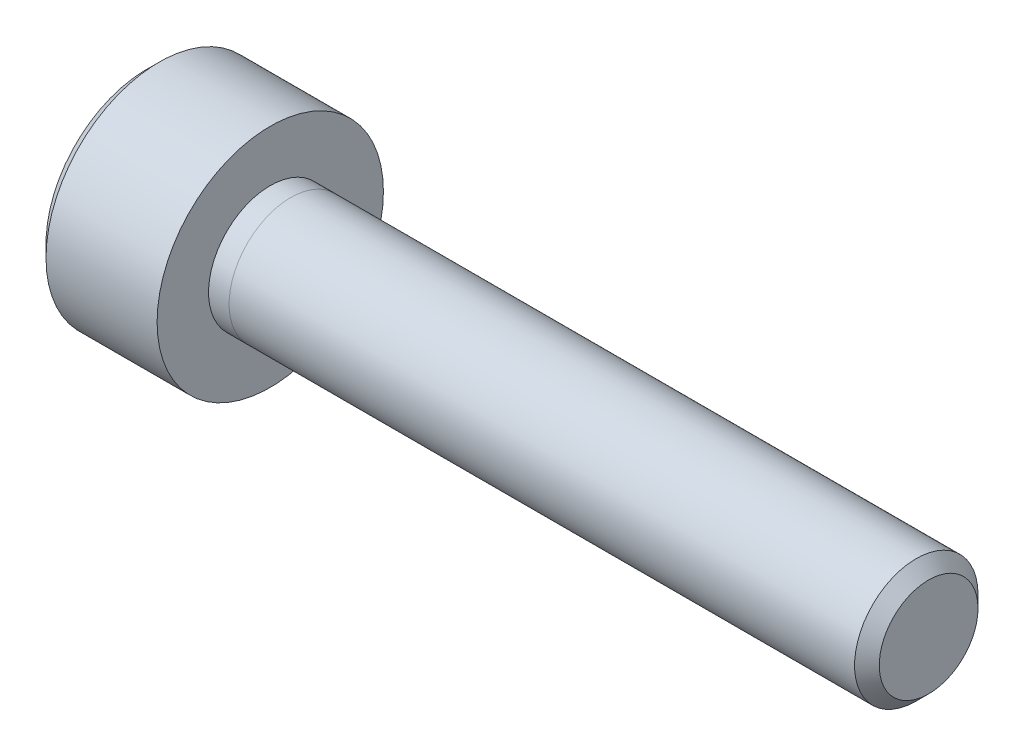
ISO-10303-21;
HEADER;
FILE_DESCRIPTION(('STEP AP214'),'2;1');
FILE_NAME('part.step','',(''),(''),'','','');
FILE_SCHEMA(('AUTOMOTIVE_DESIGN { 1 0 10303 214 1 1 1 1 }'));
ENDSEC;
DATA;
#1=APPLICATION_CONTEXT('core data for automotive mechanical design processes');
#2=APPLICATION_PROTOCOL_DEFINITION('international standard','automotive_design',2000,#1);
#3=PRODUCT_CONTEXT('',#1,'mechanical');
#4=PRODUCT('Part','Part','',(#3));
#5=PRODUCT_RELATED_PRODUCT_CATEGORY('part','',(#4));
#6=PRODUCT_DEFINITION_FORMATION('','',#4);
#7=PRODUCT_DEFINITION_CONTEXT('part definition',#1,'design');
#8=PRODUCT_DEFINITION('design','',#6,#7);
#9=PRODUCT_DEFINITION_SHAPE('','',#8);
#10=(LENGTH_UNIT() NAMED_UNIT(*) SI_UNIT(.MILLI.,.METRE.));
#11=(NAMED_UNIT(*) PLANE_ANGLE_UNIT() SI_UNIT($,.RADIAN.));
#12=(NAMED_UNIT(*) SI_UNIT($,.STERADIAN.) SOLID_ANGLE_UNIT());
#13=UNCERTAINTY_MEASURE_WITH_UNIT(LENGTH_MEASURE(1.E-05),#10,'distance_accuracy_value','');
#14=(GEOMETRIC_REPRESENTATION_CONTEXT(3) GLOBAL_UNCERTAINTY_ASSIGNED_CONTEXT((#13)) GLOBAL_UNIT_ASSIGNED_CONTEXT((#10,
#11,#12)) REPRESENTATION_CONTEXT('',''));
#15=CARTESIAN_POINT('',(0.,0.,0.));
#16=DIRECTION('',(0.,0.,1.));
#17=DIRECTION('',(1.,0.,0.));
#18=AXIS2_PLACEMENT_3D('',#15,#16,#17);
#19=CARTESIAN_POINT('',(19.,0.,0.));
#20=DIRECTION('',(-1.,0.,0.));
#21=DIRECTION('',(0.,0.,1.));
#22=AXIS2_PLACEMENT_3D('',#19,#20,#21);
#23=CYLINDRICAL_SURFACE('',#22,1.5);
#24=CARTESIAN_POINT('',(18.7,0.,0.));
#25=DIRECTION('',(1.,0.,0.));
#26=DIRECTION('',(0.,0.,-1.));
#27=AXIS2_PLACEMENT_3D('',#24,#25,#26);
#28=CIRCLE('',#27,1.5);
#29=CARTESIAN_POINT('',(18.7,0.,-1.5));
#30=VERTEX_POINT('',#29);
#31=EDGE_CURVE('E11',#30,#30,#28,.F.);
#32=ORIENTED_EDGE('',*,*,#31,.T.);
#33=EDGE_LOOP('',(#32));
#34=FACE_BOUND('',#33,.T.);
#35=CARTESIAN_POINT('',(3.5,0.,0.));
#36=DIRECTION('',(1.,0.,0.));
#37=DIRECTION('',(0.,0.,-1.));
#38=AXIS2_PLACEMENT_3D('',#35,#36,#37);
#39=CIRCLE('',#38,1.5);
#40=CARTESIAN_POINT('',(3.5,0.,-1.5));
#41=VERTEX_POINT('',#40);
#42=EDGE_CURVE('E63',#41,#41,#39,.T.);
#43=ORIENTED_EDGE('',*,*,#42,.T.);
#44=EDGE_LOOP('',(#43));
#45=FACE_BOUND('',#44,.T.);
#46=ADVANCED_FACE('F50',(#34,#45),#23,.T.);
#47=CARTESIAN_POINT('',(19.,0.,0.));
#48=DIRECTION('',(1.,0.,0.));
#49=DIRECTION('',(0.,0.,-1.));
#50=AXIS2_PLACEMENT_3D('',#47,#48,#49);
#51=PLANE('',#50);
#52=CARTESIAN_POINT('',(19.,0.,0.));
#53=DIRECTION('',(1.,0.,0.));
#54=DIRECTION('',(0.,0.,-1.));
#55=AXIS2_PLACEMENT_3D('',#52,#53,#54);
#56=CIRCLE('',#55,1.2);
#57=CARTESIAN_POINT('',(19.,0.,-1.2));
#58=VERTEX_POINT('',#57);
#59=EDGE_CURVE('E58',#58,#58,#56,.T.);
#60=ORIENTED_EDGE('',*,*,#59,.T.);
#61=EDGE_LOOP('',(#60));
#62=FACE_BOUND('',#61,.T.);
#63=ADVANCED_FACE('F74',(#62),#51,.T.);
#64=CARTESIAN_POINT('',(3.5,0.,0.));
#65=DIRECTION('',(1.,0.,0.));
#66=DIRECTION('',(0.,0.,-1.));
#67=AXIS2_PLACEMENT_3D('',#64,#65,#66);
#68=PLANE('',#67);
#69=ORIENTED_EDGE('',*,*,#42,.F.);
#70=EDGE_LOOP('',(#69));
#71=FACE_BOUND('',#70,.T.);
#72=ADVANCED_FACE('F72',(#71),#68,.F.);
#73=CARTESIAN_POINT('',(19.,0.,0.));
#74=DIRECTION('',(-1.,0.,0.));
#75=DIRECTION('',(0.,0.,1.));
#76=AXIS2_PLACEMENT_3D('',#73,#74,#75);
#77=CONICAL_SURFACE('',#76,1.2,0.785398163397449);
#78=ORIENTED_EDGE('',*,*,#31,.F.);
#79=EDGE_LOOP('',(#78));
#80=FACE_BOUND('',#79,.T.);
#81=ORIENTED_EDGE('',*,*,#59,.F.);
#82=EDGE_LOOP('',(#81));
#83=FACE_BOUND('',#82,.T.);
#84=ADVANCED_FACE('F52',(#80,#83),#77,.T.);
#85=CLOSED_SHELL('',(#46,#63,#72,#84));
#86=MANIFOLD_SOLID_BREP('B2',#85);
#87=CARTESIAN_POINT('',(3.,0.,0.));
#88=DIRECTION('',(1.,0.,0.));
#89=DIRECTION('',(0.,0.,-1.));
#90=AXIS2_PLACEMENT_3D('',#87,#88,#89);
#91=PLANE('',#90);
#92=CARTESIAN_POINT('',(3.,0.,0.));
#93=DIRECTION('',(1.,0.,0.));
#94=DIRECTION('',(0.,0.,-1.));
#95=AXIS2_PLACEMENT_3D('',#92,#93,#94);
#96=CIRCLE('',#95,2.75);
#97=CARTESIAN_POINT('',(3.,0.,-2.75));
#98=VERTEX_POINT('',#97);
#99=EDGE_CURVE('E244',#98,#98,#96,.T.);
#100=ORIENTED_EDGE('',*,*,#99,.T.);
#101=EDGE_LOOP('',(#100));
#102=FACE_BOUND('',#101,.T.);
#103=CARTESIAN_POINT('',(3.,0.,0.));
#104=DIRECTION('',(1.,0.,0.));
#105=DIRECTION('',(0.,0.,-1.));
#106=AXIS2_PLACEMENT_3D('',#103,#104,#105);
#107=CIRCLE('',#106,1.5);
#108=CARTESIAN_POINT('',(3.,0.,-1.5));
#109=VERTEX_POINT('',#108);
#110=EDGE_CURVE('E231',#109,#109,#107,.T.);
#111=ORIENTED_EDGE('',*,*,#110,.F.);
#112=EDGE_LOOP('',(#111));
#113=FACE_BOUND('',#112,.T.);
#114=ADVANCED_FACE('F114',(#102,#113),#91,.T.);
#115=CARTESIAN_POINT('',(3.,0.,0.));
#116=DIRECTION('',(-1.,0.,0.));
#117=DIRECTION('',(0.,0.,1.));
#118=AXIS2_PLACEMENT_3D('',#115,#116,#117);
#119=CYLINDRICAL_SURFACE('',#118,2.75);
#120=CARTESIAN_POINT('',(0.299999999999997,0.,0.));
#121=DIRECTION('',(1.,0.,0.));
#122=DIRECTION('',(0.,0.,-1.));
#123=AXIS2_PLACEMENT_3D('',#120,#121,#122);
#124=CIRCLE('',#123,2.75);
#125=CARTESIAN_POINT('',(0.299999999999997,0.,-2.75));
#126=VERTEX_POINT('',#125);
#127=EDGE_CURVE('E123',#126,#126,#124,.T.);
#128=ORIENTED_EDGE('',*,*,#127,.T.);
#129=EDGE_LOOP('',(#128));
#130=FACE_BOUND('',#129,.T.);
#131=ORIENTED_EDGE('',*,*,#99,.F.);
#132=EDGE_LOOP('',(#131));
#133=FACE_BOUND('',#132,.T.);
#134=ADVANCED_FACE('F253',(#130,#133),#119,.T.);
#135=CARTESIAN_POINT('',(0.,0.,0.));
#136=DIRECTION('',(1.,0.,0.));
#137=DIRECTION('',(0.,0.,-1.));
#138=AXIS2_PLACEMENT_3D('',#135,#136,#137);
#139=PLANE('',#138);
#140=DIRECTION('',(0.,0.792442347030254,-0.609946822791284));
#141=VECTOR('',#140,1.);
#142=CARTESIAN_POINT('',(0.,0.190537525520136,1.4307441367002));
#143=LINE('',#142,#141);
#144=CARTESIAN_POINT('',(0.,0.190537525520136,1.4307441367002));
#145=VERTEX_POINT('',#144);
#146=CARTESIAN_POINT('',(0.,1.33432953145808,0.550361730875436));
#147=VERTEX_POINT('',#146);
#148=EDGE_CURVE('E212',#145,#147,#143,.T.);
#149=ORIENTED_EDGE('',*,*,#148,.F.);
#150=DIRECTION('',(0.,0.924450617009985,0.381301792167121));
#151=VECTOR('',#150,1.);
#152=CARTESIAN_POINT('',(0.,-1.14379200593794,0.880382405824763));
#153=LINE('',#152,#151);
#154=CARTESIAN_POINT('',(0.,-1.14379200593794,0.880382405824763));
#155=VERTEX_POINT('',#154);
#156=EDGE_CURVE('E130',#155,#145,#153,.T.);
#157=ORIENTED_EDGE('',*,*,#156,.F.);
#158=DIRECTION('',(0.,0.132008269979731,0.991248614958406));
#159=VECTOR('',#158,1.);
#160=CARTESIAN_POINT('',(0.,-1.33432953145808,-0.550361730875436));
#161=LINE('',#160,#159);
#162=CARTESIAN_POINT('',(0.,-1.33432953145808,-0.550361730875436));
#163=VERTEX_POINT('',#162);
#164=EDGE_CURVE('E225',#163,#155,#161,.T.);
#165=ORIENTED_EDGE('',*,*,#164,.F.);
#166=DIRECTION('',(0.,-0.792442347030254,0.609946822791285));
#167=VECTOR('',#166,1.);
#168=CARTESIAN_POINT('',(0.,-0.190537525520136,-1.4307441367002));
#169=LINE('',#168,#167);
#170=CARTESIAN_POINT('',(0.,-0.190537525520136,-1.4307441367002));
#171=VERTEX_POINT('',#170);
#172=EDGE_CURVE('E222',#171,#163,#169,.T.);
#173=ORIENTED_EDGE('',*,*,#172,.F.);
#174=DIRECTION('',(0.,-0.924450617009985,-0.381301792167121));
#175=VECTOR('',#174,1.);
#176=CARTESIAN_POINT('',(0.,1.14379200593794,-0.880382405824763));
#177=LINE('',#176,#175);
#178=CARTESIAN_POINT('',(0.,1.14379200593794,-0.880382405824763));
#179=VERTEX_POINT('',#178);
#180=EDGE_CURVE('E178',#179,#171,#177,.T.);
#181=ORIENTED_EDGE('',*,*,#180,.F.);
#182=DIRECTION('',(0.,-0.132008269979731,-0.991248614958406));
#183=VECTOR('',#182,1.);
#184=CARTESIAN_POINT('',(0.,1.33432953145808,0.550361730875436));
#185=LINE('',#184,#183);
#186=EDGE_CURVE('E216',#147,#179,#185,.T.);
#187=ORIENTED_EDGE('',*,*,#186,.F.);
#188=EDGE_LOOP('',(#149,#157,#165,#173,#181,#187));
#189=FACE_BOUND('',#188,.T.);
#190=CARTESIAN_POINT('',(0.,0.,0.));
#191=DIRECTION('',(1.,0.,0.));
#192=DIRECTION('',(0.,0.,-1.));
#193=AXIS2_PLACEMENT_3D('',#190,#191,#192);
#194=CIRCLE('',#193,2.45);
#195=CARTESIAN_POINT('',(0.,0.,-2.45));
#196=VERTEX_POINT('',#195);
#197=EDGE_CURVE('E48',#196,#196,#194,.F.);
#198=ORIENTED_EDGE('',*,*,#197,.T.);
#199=EDGE_LOOP('',(#198));
#200=FACE_BOUND('',#199,.T.);
#201=ADVANCED_FACE('F276',(#189,#200),#139,.F.);
#202=CARTESIAN_POINT('',(3.5,0.,0.));
#203=DIRECTION('',(-1.,0.,0.));
#204=DIRECTION('',(0.,0.,1.));
#205=AXIS2_PLACEMENT_3D('',#202,#203,#204);
#206=CYLINDRICAL_SURFACE('',#205,1.5);
#207=CARTESIAN_POINT('',(3.5,0.,0.));
#208=DIRECTION('',(1.,0.,0.));
#209=DIRECTION('',(0.,0.,-1.));
#210=AXIS2_PLACEMENT_3D('',#207,#208,#209);
#211=CIRCLE('',#210,1.5);
#212=CARTESIAN_POINT('',(3.5,0.,-1.5));
#213=VERTEX_POINT('',#212);
#214=EDGE_CURVE('E240',#213,#213,#211,.T.);
#215=ORIENTED_EDGE('',*,*,#214,.F.);
#216=EDGE_LOOP('',(#215));
#217=FACE_BOUND('',#216,.T.);
#218=ORIENTED_EDGE('',*,*,#110,.T.);
#219=EDGE_LOOP('',(#218));
#220=FACE_BOUND('',#219,.T.);
#221=ADVANCED_FACE('F266',(#217,#220),#206,.T.);
#222=CARTESIAN_POINT('',(3.5,0.,0.));
#223=DIRECTION('',(1.,0.,0.));
#224=DIRECTION('',(0.,0.,-1.));
#225=AXIS2_PLACEMENT_3D('',#222,#223,#224);
#226=PLANE('',#225);
#227=ORIENTED_EDGE('',*,*,#214,.T.);
#228=EDGE_LOOP('',(#227));
#229=FACE_BOUND('',#228,.T.);
#230=ADVANCED_FACE('F258',(#229),#226,.T.);
#231=CARTESIAN_POINT('',(0.299999999999997,0.,0.));
#232=DIRECTION('',(1.,0.,0.));
#233=DIRECTION('',(0.,0.,-1.));
#234=AXIS2_PLACEMENT_3D('',#231,#232,#233);
#235=CONICAL_SURFACE('',#234,2.75,0.78539816339745);
#236=ORIENTED_EDGE('',*,*,#197,.F.);
#237=EDGE_LOOP('',(#236));
#238=FACE_BOUND('',#237,.T.);
#239=ORIENTED_EDGE('',*,*,#127,.F.);
#240=EDGE_LOOP('',(#239));
#241=FACE_BOUND('',#240,.T.);
#242=ADVANCED_FACE('F116',(#238,#241),#235,.T.);
#243=CARTESIAN_POINT('',(2.2,-1.14379200593794,0.880382405824763));
#244=DIRECTION('',(0.,-0.381301792167121,0.924450617009985));
#245=DIRECTION('',(0.,-0.924450617009985,-0.381301792167121));
#246=AXIS2_PLACEMENT_3D('',#243,#244,#245);
#247=PLANE('',#246);
#248=ORIENTED_EDGE('',*,*,#156,.T.);
#249=DIRECTION('',(-1.,0.,0.));
#250=VECTOR('',#249,1.);
#251=CARTESIAN_POINT('',(2.2,0.190537525520136,1.4307441367002));
#252=LINE('',#251,#250);
#253=CARTESIAN_POINT('',(2.2,0.190537525520136,1.4307441367002));
#254=VERTEX_POINT('',#253);
#255=EDGE_CURVE('E160',#254,#145,#252,.T.);
#256=ORIENTED_EDGE('',*,*,#255,.F.);
#257=DIRECTION('',(0.,0.924450617009985,0.381301792167121));
#258=VECTOR('',#257,1.);
#259=CARTESIAN_POINT('',(2.2,-1.14379200593794,0.880382405824763));
#260=LINE('',#259,#258);
#261=CARTESIAN_POINT('',(2.2,-1.14379200593794,0.880382405824763));
#262=VERTEX_POINT('',#261);
#263=EDGE_CURVE('E228',#262,#254,#260,.T.);
#264=ORIENTED_EDGE('',*,*,#263,.F.);
#265=DIRECTION('',(-1.,0.,0.));
#266=VECTOR('',#265,1.);
#267=CARTESIAN_POINT('',(2.2,-1.14379200593794,0.880382405824763));
#268=LINE('',#267,#266);
#269=EDGE_CURVE('E138',#262,#155,#268,.T.);
#270=ORIENTED_EDGE('',*,*,#269,.T.);
#271=EDGE_LOOP('',(#248,#256,#264,#270));
#272=FACE_BOUND('',#271,.T.);
#273=ADVANCED_FACE('F257',(#272),#247,.F.);
#274=CARTESIAN_POINT('',(2.2,-1.33432953145808,-0.550361730875436));
#275=DIRECTION('',(0.,-0.991248614958406,0.132008269979731));
#276=DIRECTION('',(0.,-0.132008269979731,-0.991248614958406));
#277=AXIS2_PLACEMENT_3D('',#274,#275,#276);
#278=PLANE('',#277);
#279=ORIENTED_EDGE('',*,*,#164,.T.);
#280=ORIENTED_EDGE('',*,*,#269,.F.);
#281=DIRECTION('',(0.,0.132008269979731,0.991248614958406));
#282=VECTOR('',#281,1.);
#283=CARTESIAN_POINT('',(2.2,-1.33432953145808,-0.550361730875436));
#284=LINE('',#283,#282);
#285=CARTESIAN_POINT('',(2.2,-1.33432953145808,-0.550361730875436));
#286=VERTEX_POINT('',#285);
#287=EDGE_CURVE('E192',#286,#262,#284,.T.);
#288=ORIENTED_EDGE('',*,*,#287,.F.);
#289=DIRECTION('',(-1.,0.,0.));
#290=VECTOR('',#289,1.);
#291=CARTESIAN_POINT('',(2.2,-1.33432953145808,-0.550361730875436));
#292=LINE('',#291,#290);
#293=EDGE_CURVE('E183',#286,#163,#292,.T.);
#294=ORIENTED_EDGE('',*,*,#293,.T.);
#295=EDGE_LOOP('',(#279,#280,#288,#294));
#296=FACE_BOUND('',#295,.T.);
#297=ADVANCED_FACE('F264',(#296),#278,.F.);
#298=CARTESIAN_POINT('',(2.2,-0.190537525520136,-1.4307441367002));
#299=DIRECTION('',(0.,-0.609946822791284,-0.792442347030254));
#300=DIRECTION('',(0.,0.792442347030254,-0.609946822791285));
#301=AXIS2_PLACEMENT_3D('',#298,#299,#300);
#302=PLANE('',#301);
#303=ORIENTED_EDGE('',*,*,#172,.T.);
#304=ORIENTED_EDGE('',*,*,#293,.F.);
#305=DIRECTION('',(0.,-0.792442347030254,0.609946822791285));
#306=VECTOR('',#305,1.);
#307=CARTESIAN_POINT('',(2.2,-0.190537525520136,-1.4307441367002));
#308=LINE('',#307,#306);
#309=CARTESIAN_POINT('',(2.2,-0.190537525520136,-1.4307441367002));
#310=VERTEX_POINT('',#309);
#311=EDGE_CURVE('E187',#310,#286,#308,.T.);
#312=ORIENTED_EDGE('',*,*,#311,.F.);
#313=DIRECTION('',(-1.,0.,0.));
#314=VECTOR('',#313,1.);
#315=CARTESIAN_POINT('',(2.2,-0.190537525520136,-1.4307441367002));
#316=LINE('',#315,#314);
#317=EDGE_CURVE('E171',#310,#171,#316,.T.);
#318=ORIENTED_EDGE('',*,*,#317,.T.);
#319=EDGE_LOOP('',(#303,#304,#312,#318));
#320=FACE_BOUND('',#319,.T.);
#321=ADVANCED_FACE('F188',(#320),#302,.F.);
#322=CARTESIAN_POINT('',(2.2,1.14379200593794,-0.880382405824763));
#323=DIRECTION('',(0.,0.381301792167121,-0.924450617009985));
#324=DIRECTION('',(0.,0.924450617009985,0.381301792167122));
#325=AXIS2_PLACEMENT_3D('',#322,#323,#324);
#326=PLANE('',#325);
#327=ORIENTED_EDGE('',*,*,#180,.T.);
#328=ORIENTED_EDGE('',*,*,#317,.F.);
#329=DIRECTION('',(0.,-0.924450617009985,-0.381301792167121));
#330=VECTOR('',#329,1.);
#331=CARTESIAN_POINT('',(2.2,1.14379200593794,-0.880382405824763));
#332=LINE('',#331,#330);
#333=CARTESIAN_POINT('',(2.2,1.14379200593794,-0.880382405824763));
#334=VERTEX_POINT('',#333);
#335=EDGE_CURVE('E175',#334,#310,#332,.T.);
#336=ORIENTED_EDGE('',*,*,#335,.F.);
#337=DIRECTION('',(-1.,0.,0.));
#338=VECTOR('',#337,1.);
#339=CARTESIAN_POINT('',(2.2,1.14379200593794,-0.880382405824763));
#340=LINE('',#339,#338);
#341=EDGE_CURVE('E184',#334,#179,#340,.T.);
#342=ORIENTED_EDGE('',*,*,#341,.T.);
#343=EDGE_LOOP('',(#327,#328,#336,#342));
#344=FACE_BOUND('',#343,.T.);
#345=ADVANCED_FACE('F173',(#344),#326,.F.);
#346=CARTESIAN_POINT('',(2.2,1.33432953145808,0.550361730875436));
#347=DIRECTION('',(0.,0.991248614958406,-0.132008269979731));
#348=DIRECTION('',(0.,0.132008269979731,0.991248614958406));
#349=AXIS2_PLACEMENT_3D('',#346,#347,#348);
#350=PLANE('',#349);
#351=ORIENTED_EDGE('',*,*,#186,.T.);
#352=ORIENTED_EDGE('',*,*,#341,.F.);
#353=DIRECTION('',(0.,-0.132008269979731,-0.991248614958406));
#354=VECTOR('',#353,1.);
#355=CARTESIAN_POINT('',(2.2,1.33432953145808,0.550361730875436));
#356=LINE('',#355,#354);
#357=CARTESIAN_POINT('',(2.2,1.33432953145808,0.550361730875436));
#358=VERTEX_POINT('',#357);
#359=EDGE_CURVE('E198',#358,#334,#356,.T.);
#360=ORIENTED_EDGE('',*,*,#359,.F.);
#361=DIRECTION('',(-1.,0.,0.));
#362=VECTOR('',#361,1.);
#363=CARTESIAN_POINT('',(2.2,1.33432953145808,0.550361730875436));
#364=LINE('',#363,#362);
#365=EDGE_CURVE('E236',#358,#147,#364,.T.);
#366=ORIENTED_EDGE('',*,*,#365,.T.);
#367=EDGE_LOOP('',(#351,#352,#360,#366));
#368=FACE_BOUND('',#367,.T.);
#369=ADVANCED_FACE('F305',(#368),#350,.F.);
#370=CARTESIAN_POINT('',(2.2,0.190537525520136,1.4307441367002));
#371=DIRECTION('',(0.,0.609946822791285,0.792442347030254));
#372=DIRECTION('',(0.,-0.792442347030254,0.609946822791285));
#373=AXIS2_PLACEMENT_3D('',#370,#371,#372);
#374=PLANE('',#373);
#375=ORIENTED_EDGE('',*,*,#148,.T.);
#376=ORIENTED_EDGE('',*,*,#365,.F.);
#377=DIRECTION('',(0.,0.792442347030254,-0.609946822791284));
#378=VECTOR('',#377,1.);
#379=CARTESIAN_POINT('',(2.2,0.190537525520136,1.4307441367002));
#380=LINE('',#379,#378);
#381=EDGE_CURVE('E204',#254,#358,#380,.T.);
#382=ORIENTED_EDGE('',*,*,#381,.F.);
#383=ORIENTED_EDGE('',*,*,#255,.T.);
#384=EDGE_LOOP('',(#375,#376,#382,#383));
#385=FACE_BOUND('',#384,.T.);
#386=ADVANCED_FACE('F291',(#385),#374,.F.);
#387=CARTESIAN_POINT('',(2.2,0.,0.));
#388=DIRECTION('',(-1.,0.,0.));
#389=DIRECTION('',(0.,0.,1.));
#390=AXIS2_PLACEMENT_3D('',#387,#388,#389);
#391=PLANE('',#390);
#392=ORIENTED_EDGE('',*,*,#263,.T.);
#393=ORIENTED_EDGE('',*,*,#381,.T.);
#394=ORIENTED_EDGE('',*,*,#359,.T.);
#395=ORIENTED_EDGE('',*,*,#335,.T.);
#396=ORIENTED_EDGE('',*,*,#311,.T.);
#397=ORIENTED_EDGE('',*,*,#287,.T.);
#398=EDGE_LOOP('',(#392,#393,#394,#395,#396,#397));
#399=FACE_BOUND('',#398,.T.);
#400=ADVANCED_FACE('F195',(#399),#391,.T.);
#401=CLOSED_SHELL('',(#114,#134,#201,#221,#230,#242,#273,#297,#321,#345,#369,#386,#400));
#402=MANIFOLD_SOLID_BREP('B6',#401);
#403=ADVANCED_BREP_SHAPE_REPRESENTATION('',(#18,#86,#402),#14);
#404=SHAPE_DEFINITION_REPRESENTATION(#9,#403);
ENDSEC;
END-ISO-10303-21;
